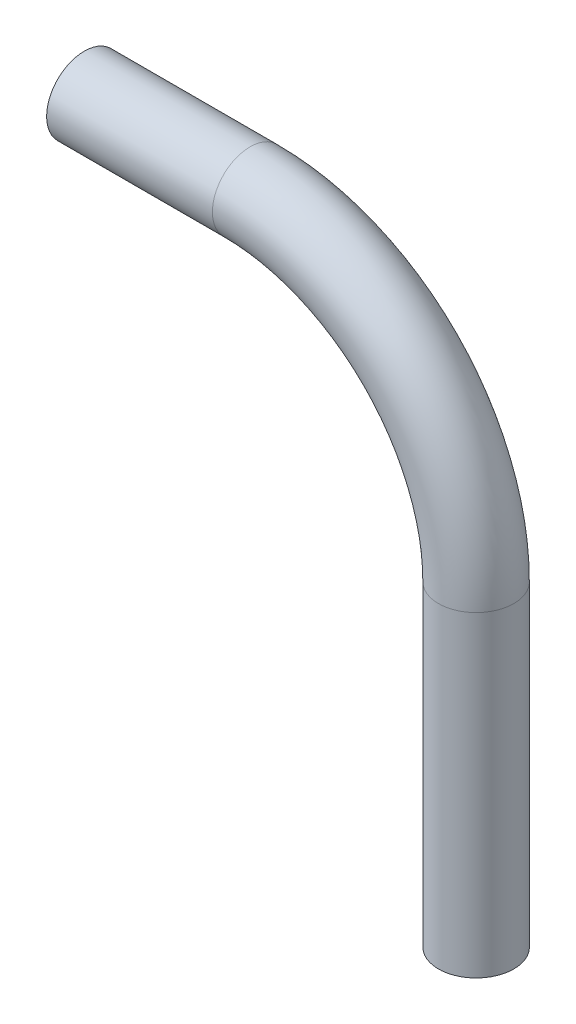
ISO-10303-21;
HEADER;
FILE_DESCRIPTION(('STEP AP214'),'2;1');
FILE_NAME('part.step','',(''),(''),'','','');
FILE_SCHEMA(('AUTOMOTIVE_DESIGN { 1 0 10303 214 1 1 1 1 }'));
ENDSEC;
DATA;
#1=APPLICATION_CONTEXT('core data for automotive mechanical design processes');
#2=APPLICATION_PROTOCOL_DEFINITION('international standard','automotive_design',2000,#1);
#3=PRODUCT_CONTEXT('',#1,'mechanical');
#4=PRODUCT('Part','Part','',(#3));
#5=PRODUCT_RELATED_PRODUCT_CATEGORY('part','',(#4));
#6=PRODUCT_DEFINITION_FORMATION('','',#4);
#7=PRODUCT_DEFINITION_CONTEXT('part definition',#1,'design');
#8=PRODUCT_DEFINITION('design','',#6,#7);
#9=PRODUCT_DEFINITION_SHAPE('','',#8);
#10=(LENGTH_UNIT() NAMED_UNIT(*) SI_UNIT(.MILLI.,.METRE.));
#11=(NAMED_UNIT(*) PLANE_ANGLE_UNIT() SI_UNIT($,.RADIAN.));
#12=(NAMED_UNIT(*) SI_UNIT($,.STERADIAN.) SOLID_ANGLE_UNIT());
#13=UNCERTAINTY_MEASURE_WITH_UNIT(LENGTH_MEASURE(1.E-05),#10,'distance_accuracy_value','');
#14=(GEOMETRIC_REPRESENTATION_CONTEXT(3) GLOBAL_UNCERTAINTY_ASSIGNED_CONTEXT((#13)) GLOBAL_UNIT_ASSIGNED_CONTEXT((#10,
#11,#12)) REPRESENTATION_CONTEXT('',''));
#15=CARTESIAN_POINT('',(0.,0.,0.));
#16=DIRECTION('',(0.,0.,1.));
#17=DIRECTION('',(1.,0.,0.));
#18=AXIS2_PLACEMENT_3D('',#15,#16,#17);
#19=CARTESIAN_POINT('',(35.3113733794378,20.9627042447267,0.));
#20=DIRECTION('',(1.,0.,0.));
#21=DIRECTION('',(0.,0.,-1.));
#22=AXIS2_PLACEMENT_3D('',#19,#20,#21);
#23=CYLINDRICAL_SURFACE('',#22,3.175);
#24=CARTESIAN_POINT('',(49.2813733794378,20.9627042447267,0.));
#25=DIRECTION('',(1.,0.,0.));
#26=DIRECTION('',(0.,1.,0.));
#27=AXIS2_PLACEMENT_3D('',#24,#25,#26);
#28=CIRCLE('',#27,3.175);
#29=CARTESIAN_POINT('',(49.2813733794378,24.1377042447266,0.));
#30=VERTEX_POINT('',#29);
#31=EDGE_CURVE('E64',#30,#30,#28,.T.);
#32=ORIENTED_EDGE('',*,*,#31,.F.);
#33=EDGE_LOOP('',(#32));
#34=FACE_BOUND('',#33,.T.);
#35=CARTESIAN_POINT('',(35.3113733794378,20.9627042447267,0.));
#36=DIRECTION('',(1.,0.,0.));
#37=DIRECTION('',(0.,1.,0.));
#38=AXIS2_PLACEMENT_3D('',#35,#36,#37);
#39=CIRCLE('',#38,3.175);
#40=CARTESIAN_POINT('',(35.3113733794378,24.1377042447267,0.));
#41=VERTEX_POINT('',#40);
#42=EDGE_CURVE('E61',#41,#41,#39,.T.);
#43=ORIENTED_EDGE('',*,*,#42,.T.);
#44=EDGE_LOOP('',(#43));
#45=FACE_BOUND('',#44,.T.);
#46=ADVANCED_FACE('F37',(#34,#45),#23,.T.);
#47=CARTESIAN_POINT('',(49.2813733794378,1.91270424472662,0.));
#48=DIRECTION('',(0.,0.,-1.));
#49=DIRECTION('',(-1.,0.,0.));
#50=AXIS2_PLACEMENT_3D('',#47,#48,#49);
#51=TOROIDAL_SURFACE('',#50,19.0499999999999,3.175);
#52=CARTESIAN_POINT('',(68.3313733794378,1.91270424472662,0.));
#53=DIRECTION('',(0.,-1.,0.));
#54=DIRECTION('',(1.,0.,0.));
#55=AXIS2_PLACEMENT_3D('',#52,#53,#54);
#56=CIRCLE('',#55,3.175);
#57=CARTESIAN_POINT('',(71.5063733794378,1.91270424472662,0.));
#58=VERTEX_POINT('',#57);
#59=EDGE_CURVE('E41',#58,#58,#56,.T.);
#60=CARTESIAN_POINT('',(49.2813733794378,1.91270424472662,0.));
#61=DIRECTION('',(0.,0.,-1.));
#62=DIRECTION('',(-1.,0.,0.));
#63=AXIS2_PLACEMENT_3D('',#60,#61,#62);
#64=CIRCLE('',#63,22.2249999999999);
#65=EDGE_CURVE('',#30,#58,#64,.T.);
#66=ORIENTED_EDGE('',*,*,#31,.T.);
#67=ORIENTED_EDGE('',*,*,#59,.F.);
#68=ORIENTED_EDGE('',*,*,#65,.T.);
#69=ORIENTED_EDGE('',*,*,#65,.F.);
#70=EDGE_LOOP('',(#66,#68,#67,#69));
#71=FACE_BOUND('',#70,.T.);
#72=ADVANCED_FACE('F74',(#71),#51,.T.);
#73=CARTESIAN_POINT('',(68.3313733794378,1.91270424472662,0.));
#74=DIRECTION('',(0.,-1.,0.));
#75=DIRECTION('',(1.,0.,0.));
#76=AXIS2_PLACEMENT_3D('',#73,#74,#75);
#77=CYLINDRICAL_SURFACE('',#76,3.175);
#78=CARTESIAN_POINT('',(68.3313733794377,-24.7572957552733,0.));
#79=DIRECTION('',(0.,-1.,0.));
#80=DIRECTION('',(1.,0.,0.));
#81=AXIS2_PLACEMENT_3D('',#78,#79,#80);
#82=CIRCLE('',#81,3.175);
#83=CARTESIAN_POINT('',(71.5063733794377,-24.7572957552733,0.));
#84=VERTEX_POINT('',#83);
#85=EDGE_CURVE('E56',#84,#84,#82,.T.);
#86=ORIENTED_EDGE('',*,*,#85,.F.);
#87=EDGE_LOOP('',(#86));
#88=FACE_BOUND('',#87,.T.);
#89=ORIENTED_EDGE('',*,*,#59,.T.);
#90=EDGE_LOOP('',(#89));
#91=FACE_BOUND('',#90,.T.);
#92=ADVANCED_FACE('F39',(#88,#91),#77,.T.);
#93=CARTESIAN_POINT('',(35.3113733794378,20.9627042447267,0.));
#94=DIRECTION('',(1.,0.,0.));
#95=DIRECTION('',(0.,1.,0.));
#96=AXIS2_PLACEMENT_3D('',#93,#94,#95);
#97=PLANE('',#96);
#98=CARTESIAN_POINT('',(35.3113733794378,20.9627042447267,0.));
#99=DIRECTION('',(1.,0.,0.));
#100=DIRECTION('',(0.,1.,0.));
#101=AXIS2_PLACEMENT_3D('',#98,#99,#100);
#102=CIRCLE('',#101,1.524);
#103=CARTESIAN_POINT('',(35.3113733794378,22.4867042447267,0.));
#104=VERTEX_POINT('',#103);
#105=EDGE_CURVE('E60',#104,#104,#102,.F.);
#106=ORIENTED_EDGE('',*,*,#105,.F.);
#107=EDGE_LOOP('',(#106));
#108=FACE_BOUND('',#107,.T.);
#109=ORIENTED_EDGE('',*,*,#42,.F.);
#110=EDGE_LOOP('',(#109));
#111=FACE_BOUND('',#110,.T.);
#112=ADVANCED_FACE('F80',(#108,#111),#97,.F.);
#113=CARTESIAN_POINT('',(68.3313733794377,-24.7572957552733,0.));
#114=DIRECTION('',(0.,-1.,0.));
#115=DIRECTION('',(1.,0.,0.));
#116=AXIS2_PLACEMENT_3D('',#113,#114,#115);
#117=PLANE('',#116);
#118=CARTESIAN_POINT('',(68.3313733794377,-24.7572957552733,0.));
#119=DIRECTION('',(0.,-1.,0.));
#120=DIRECTION('',(1.,0.,0.));
#121=AXIS2_PLACEMENT_3D('',#118,#119,#120);
#122=CIRCLE('',#121,1.524);
#123=CARTESIAN_POINT('',(69.8553733794377,-24.7572957552733,0.));
#124=VERTEX_POINT('',#123);
#125=EDGE_CURVE('E10',#124,#124,#122,.F.);
#126=ORIENTED_EDGE('',*,*,#125,.T.);
#127=EDGE_LOOP('',(#126));
#128=FACE_BOUND('',#127,.T.);
#129=ORIENTED_EDGE('',*,*,#85,.T.);
#130=EDGE_LOOP('',(#129));
#131=FACE_BOUND('',#130,.T.);
#132=ADVANCED_FACE('F98',(#128,#131),#117,.T.);
#133=CARTESIAN_POINT('',(35.3113733794378,20.9627042447267,0.));
#134=DIRECTION('',(1.,0.,0.));
#135=DIRECTION('',(0.,0.,-1.));
#136=AXIS2_PLACEMENT_3D('',#133,#134,#135);
#137=CYLINDRICAL_SURFACE('',#136,1.524);
#138=CARTESIAN_POINT('',(49.2813733794378,20.9627042447267,0.));
#139=DIRECTION('',(1.,0.,0.));
#140=DIRECTION('',(0.,1.,0.));
#141=AXIS2_PLACEMENT_3D('',#138,#139,#140);
#142=CIRCLE('',#141,1.524);
#143=CARTESIAN_POINT('',(49.2813733794378,22.4867042447266,0.));
#144=VERTEX_POINT('',#143);
#145=EDGE_CURVE('E52',#144,#144,#142,.F.);
#146=ORIENTED_EDGE('',*,*,#145,.F.);
#147=EDGE_LOOP('',(#146));
#148=FACE_BOUND('',#147,.T.);
#149=ORIENTED_EDGE('',*,*,#105,.T.);
#150=EDGE_LOOP('',(#149));
#151=FACE_BOUND('',#150,.T.);
#152=ADVANCED_FACE('F92',(#148,#151),#137,.F.);
#153=CARTESIAN_POINT('',(49.2813733794378,1.91270424472662,0.));
#154=DIRECTION('',(0.,0.,-1.));
#155=DIRECTION('',(-1.,0.,0.));
#156=AXIS2_PLACEMENT_3D('',#153,#154,#155);
#157=TOROIDAL_SURFACE('',#156,19.0499999999999,1.524);
#158=CARTESIAN_POINT('',(68.3313733794378,1.91270424472662,0.));
#159=DIRECTION('',(0.,-1.,0.));
#160=DIRECTION('',(1.,0.,0.));
#161=AXIS2_PLACEMENT_3D('',#158,#159,#160);
#162=CIRCLE('',#161,1.524);
#163=CARTESIAN_POINT('',(69.8553733794378,1.91270424472662,0.));
#164=VERTEX_POINT('',#163);
#165=EDGE_CURVE('E46',#164,#164,#162,.F.);
#166=CARTESIAN_POINT('',(49.2813733794378,1.91270424472662,0.));
#167=DIRECTION('',(0.,0.,-1.));
#168=DIRECTION('',(-1.,0.,0.));
#169=AXIS2_PLACEMENT_3D('',#166,#167,#168);
#170=CIRCLE('',#169,20.5739999999999);
#171=EDGE_CURVE('',#144,#164,#170,.T.);
#172=ORIENTED_EDGE('',*,*,#145,.T.);
#173=ORIENTED_EDGE('',*,*,#165,.F.);
#174=ORIENTED_EDGE('',*,*,#171,.T.);
#175=ORIENTED_EDGE('',*,*,#171,.F.);
#176=EDGE_LOOP('',(#172,#174,#173,#175));
#177=FACE_BOUND('',#176,.T.);
#178=ADVANCED_FACE('F86',(#177),#157,.F.);
#179=CARTESIAN_POINT('',(68.3313733794378,1.91270424472662,0.));
#180=DIRECTION('',(0.,-1.,0.));
#181=DIRECTION('',(1.,0.,0.));
#182=AXIS2_PLACEMENT_3D('',#179,#180,#181);
#183=CYLINDRICAL_SURFACE('',#182,1.524);
#184=ORIENTED_EDGE('',*,*,#125,.F.);
#185=EDGE_LOOP('',(#184));
#186=FACE_BOUND('',#185,.T.);
#187=ORIENTED_EDGE('',*,*,#165,.T.);
#188=EDGE_LOOP('',(#187));
#189=FACE_BOUND('',#188,.T.);
#190=ADVANCED_FACE('F84',(#186,#189),#183,.F.);
#191=CLOSED_SHELL('',(#46,#72,#92,#112,#132,#152,#178,#190));
#192=MANIFOLD_SOLID_BREP('B2',#191);
#193=ADVANCED_BREP_SHAPE_REPRESENTATION('',(#18,#192),#14);
#194=SHAPE_DEFINITION_REPRESENTATION(#9,#193);
ENDSEC;
END-ISO-10303-21;
